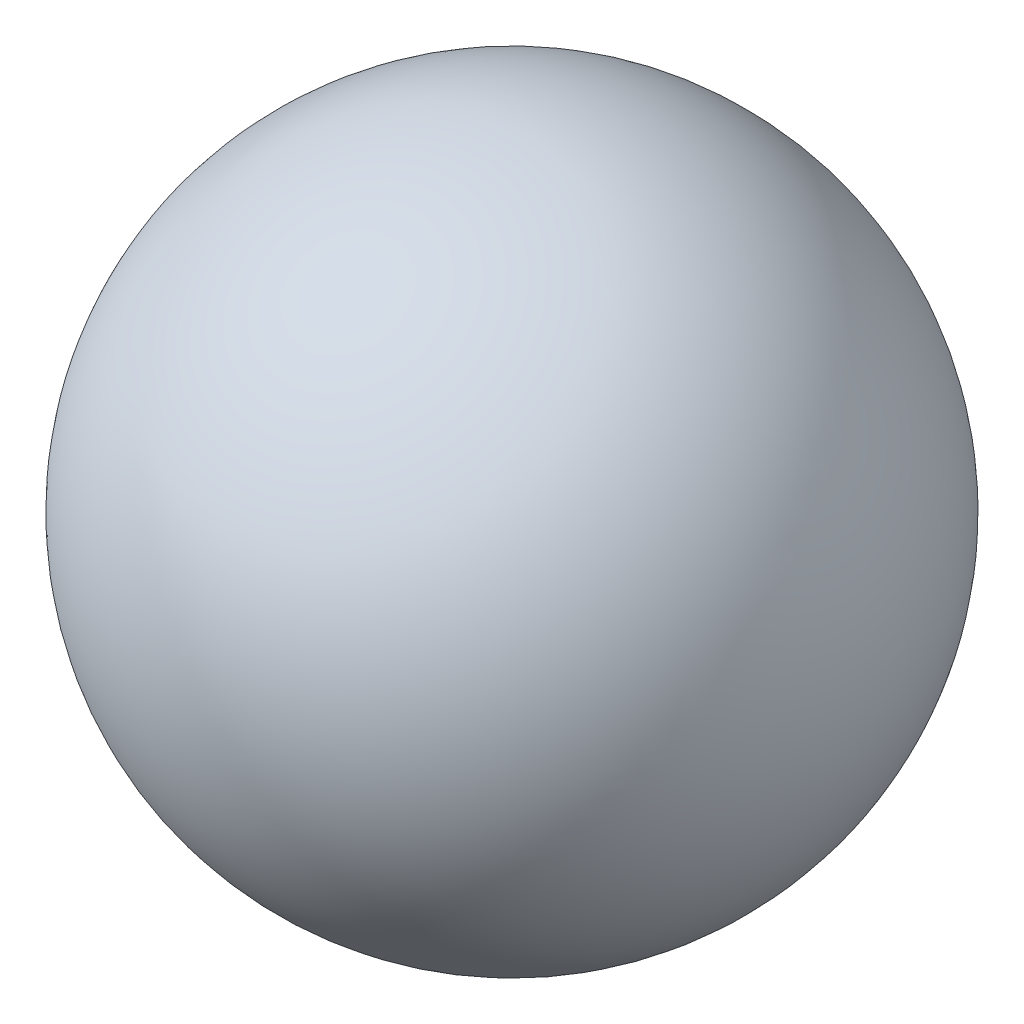
ISO-10303-21;
HEADER;
FILE_DESCRIPTION(('STEP AP214'),'2;1');
FILE_NAME('part.step','',(''),(''),'','','');
FILE_SCHEMA(('AUTOMOTIVE_DESIGN { 1 0 10303 214 1 1 1 1 }'));
ENDSEC;
DATA;
#1=APPLICATION_CONTEXT('core data for automotive mechanical design processes');
#2=APPLICATION_PROTOCOL_DEFINITION('international standard','automotive_design',2000,#1);
#3=PRODUCT_CONTEXT('',#1,'mechanical');
#4=PRODUCT('Part','Part','',(#3));
#5=PRODUCT_RELATED_PRODUCT_CATEGORY('part','',(#4));
#6=PRODUCT_DEFINITION_FORMATION('','',#4);
#7=PRODUCT_DEFINITION_CONTEXT('part definition',#1,'design');
#8=PRODUCT_DEFINITION('design','',#6,#7);
#9=PRODUCT_DEFINITION_SHAPE('','',#8);
#10=(LENGTH_UNIT() NAMED_UNIT(*) SI_UNIT(.MILLI.,.METRE.));
#11=(NAMED_UNIT(*) PLANE_ANGLE_UNIT() SI_UNIT($,.RADIAN.));
#12=(NAMED_UNIT(*) SI_UNIT($,.STERADIAN.) SOLID_ANGLE_UNIT());
#13=UNCERTAINTY_MEASURE_WITH_UNIT(LENGTH_MEASURE(1.E-05),#10,'distance_accuracy_value','');
#14=(GEOMETRIC_REPRESENTATION_CONTEXT(3) GLOBAL_UNCERTAINTY_ASSIGNED_CONTEXT((#13)) GLOBAL_UNIT_ASSIGNED_CONTEXT((#10,
#11,#12)) REPRESENTATION_CONTEXT('',''));
#15=CARTESIAN_POINT('',(0.,0.,0.));
#16=DIRECTION('',(0.,0.,1.));
#17=DIRECTION('',(1.,0.,0.));
#18=AXIS2_PLACEMENT_3D('',#15,#16,#17);
#19=CARTESIAN_POINT('',(0.,0.,0.));
#20=DIRECTION('',(-0.999999999999999,0.,0.));
#21=DIRECTION('',(0.,0.999999999999999,0.));
#22=AXIS2_PLACEMENT_3D('',#19,#20,#21);
#23=SPHERICAL_SURFACE('',#22,12.);
#24=CARTESIAN_POINT('',(-12.,0.,0.));
#25=VERTEX_POINT('',#24);
#26=VERTEX_LOOP('',#25);
#27=FACE_BOUND('',#26,.T.);
#28=ADVANCED_FACE('F34',(#27),#23,.T.);
#29=CLOSED_SHELL('',(#28));
#30=MANIFOLD_SOLID_BREP('B2',#29);
#31=ADVANCED_BREP_SHAPE_REPRESENTATION('',(#18,#30),#14);
#32=SHAPE_DEFINITION_REPRESENTATION(#9,#31);
ENDSEC;
END-ISO-10303-21;
